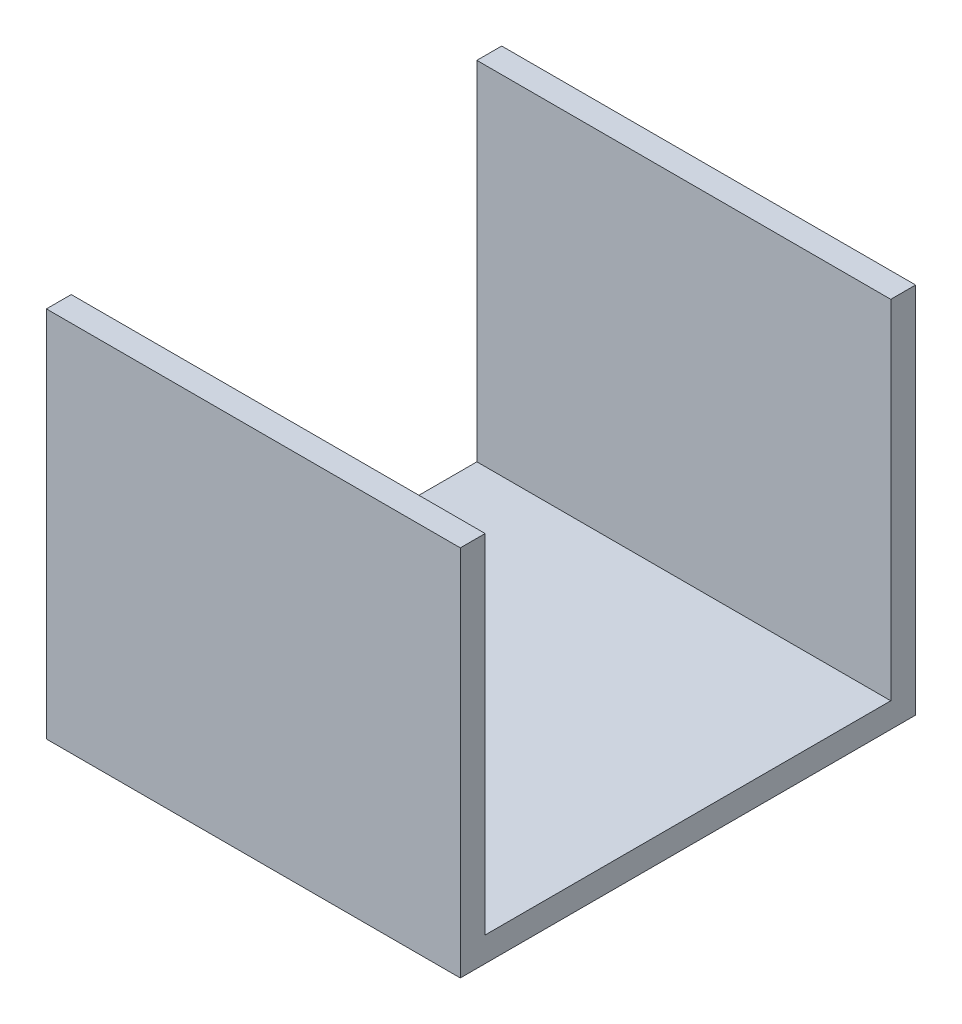
ISO-10303-21;
HEADER;
FILE_DESCRIPTION(('STEP AP214'),'2;1');
FILE_NAME('part.step','',(''),(''),'','','');
FILE_SCHEMA(('AUTOMOTIVE_DESIGN { 1 0 10303 214 1 1 1 1 }'));
ENDSEC;
DATA;
#1=APPLICATION_CONTEXT('core data for automotive mechanical design processes');
#2=APPLICATION_PROTOCOL_DEFINITION('international standard','automotive_design',2000,#1);
#3=PRODUCT_CONTEXT('',#1,'mechanical');
#4=PRODUCT('Part','Part','',(#3));
#5=PRODUCT_RELATED_PRODUCT_CATEGORY('part','',(#4));
#6=PRODUCT_DEFINITION_FORMATION('','',#4);
#7=PRODUCT_DEFINITION_CONTEXT('part definition',#1,'design');
#8=PRODUCT_DEFINITION('design','',#6,#7);
#9=PRODUCT_DEFINITION_SHAPE('','',#8);
#10=(LENGTH_UNIT() NAMED_UNIT(*) SI_UNIT(.MILLI.,.METRE.));
#11=(NAMED_UNIT(*) PLANE_ANGLE_UNIT() SI_UNIT($,.RADIAN.));
#12=(NAMED_UNIT(*) SI_UNIT($,.STERADIAN.) SOLID_ANGLE_UNIT());
#13=UNCERTAINTY_MEASURE_WITH_UNIT(LENGTH_MEASURE(1.E-05),#10,'distance_accuracy_value','');
#14=(GEOMETRIC_REPRESENTATION_CONTEXT(3) GLOBAL_UNCERTAINTY_ASSIGNED_CONTEXT((#13)) GLOBAL_UNIT_ASSIGNED_CONTEXT((#10,
#11,#12)) REPRESENTATION_CONTEXT('',''));
#15=CARTESIAN_POINT('',(0.,0.,0.));
#16=DIRECTION('',(0.,0.,1.));
#17=DIRECTION('',(1.,0.,0.));
#18=AXIS2_PLACEMENT_3D('',#15,#16,#17);
#19=CARTESIAN_POINT('',(0.65,0.005,0.));
#20=DIRECTION('',(0.,-1.,0.));
#21=DIRECTION('',(0.707106781186548,0.,0.707106781186548));
#22=AXIS2_PLACEMENT_3D('',#19,#20,#21);
#23=PLANE('',#22);
#24=DIRECTION('',(1.,0.,0.));
#25=VECTOR('',#24,1.);
#26=CARTESIAN_POINT('',(0.65,0.005,0.03));
#27=LINE('',#26,#25);
#28=CARTESIAN_POINT('',(0.65,0.005,0.03));
#29=VERTEX_POINT('',#28);
#30=CARTESIAN_POINT('',(1.15,0.005,0.03));
#31=VERTEX_POINT('',#30);
#32=EDGE_CURVE('E34',#29,#31,#27,.T.);
#33=ORIENTED_EDGE('',*,*,#32,.F.);
#34=DIRECTION('',(0.,0.,1.));
#35=VECTOR('',#34,1.);
#36=CARTESIAN_POINT('',(0.65,0.005,0.03));
#37=LINE('',#36,#35);
#38=CARTESIAN_POINT('',(0.65,0.005,0.52));
#39=VERTEX_POINT('',#38);
#40=EDGE_CURVE('E11',#29,#39,#37,.T.);
#41=ORIENTED_EDGE('',*,*,#40,.T.);
#42=DIRECTION('',(1.,0.,0.));
#43=VECTOR('',#42,1.);
#44=CARTESIAN_POINT('',(0.65,0.005,0.52));
#45=LINE('',#44,#43);
#46=CARTESIAN_POINT('',(1.15,0.005,0.52));
#47=VERTEX_POINT('',#46);
#48=EDGE_CURVE('E26',#39,#47,#45,.T.);
#49=ORIENTED_EDGE('',*,*,#48,.T.);
#50=DIRECTION('',(0.,0.,1.));
#51=VECTOR('',#50,1.);
#52=CARTESIAN_POINT('',(1.15,0.005,0.03));
#53=LINE('',#52,#51);
#54=EDGE_CURVE('E139',#31,#47,#53,.T.);
#55=ORIENTED_EDGE('',*,*,#54,.F.);
#56=EDGE_LOOP('',(#33,#41,#49,#55));
#57=FACE_BOUND('',#56,.T.);
#58=ADVANCED_FACE('F16',(#57),#23,.F.);
#59=CARTESIAN_POINT('',(0.8,0.,0.52));
#60=DIRECTION('',(0.,0.,1.));
#61=DIRECTION('',(0.707106781186548,0.707106781186548,0.));
#62=AXIS2_PLACEMENT_3D('',#59,#60,#61);
#63=PLANE('',#62);
#64=DIRECTION('',(-1.,0.,0.));
#65=VECTOR('',#64,1.);
#66=CARTESIAN_POINT('',(1.15,0.425,0.52));
#67=LINE('',#66,#65);
#68=CARTESIAN_POINT('',(1.15,0.425,0.52));
#69=VERTEX_POINT('',#68);
#70=CARTESIAN_POINT('',(0.65,0.425,0.52));
#71=VERTEX_POINT('',#70);
#72=EDGE_CURVE('E122',#69,#71,#67,.T.);
#73=ORIENTED_EDGE('',*,*,#72,.F.);
#74=DIRECTION('',(0.,1.,0.));
#75=VECTOR('',#74,1.);
#76=CARTESIAN_POINT('',(1.15,0.005,0.52));
#77=LINE('',#76,#75);
#78=EDGE_CURVE('E118',#47,#69,#77,.T.);
#79=ORIENTED_EDGE('',*,*,#78,.F.);
#80=ORIENTED_EDGE('',*,*,#48,.F.);
#81=DIRECTION('',(0.,-1.,0.));
#82=VECTOR('',#81,1.);
#83=CARTESIAN_POINT('',(0.65,0.425,0.52));
#84=LINE('',#83,#82);
#85=EDGE_CURVE('E114',#71,#39,#84,.T.);
#86=ORIENTED_EDGE('',*,*,#85,.F.);
#87=EDGE_LOOP('',(#73,#79,#80,#86));
#88=FACE_BOUND('',#87,.T.);
#89=ADVANCED_FACE('F156',(#88),#63,.F.);
#90=CARTESIAN_POINT('',(0.8,0.,0.03));
#91=DIRECTION('',(0.,0.,1.));
#92=DIRECTION('',(0.707106781186548,0.707106781186548,0.));
#93=AXIS2_PLACEMENT_3D('',#90,#91,#92);
#94=PLANE('',#93);
#95=DIRECTION('',(0.,1.,0.));
#96=VECTOR('',#95,1.);
#97=CARTESIAN_POINT('',(1.15,0.005,0.03));
#98=LINE('',#97,#96);
#99=CARTESIAN_POINT('',(1.15,0.425,0.03));
#100=VERTEX_POINT('',#99);
#101=EDGE_CURVE('E134',#31,#100,#98,.T.);
#102=ORIENTED_EDGE('',*,*,#101,.T.);
#103=DIRECTION('',(-1.,0.,0.));
#104=VECTOR('',#103,1.);
#105=CARTESIAN_POINT('',(1.15,0.425,0.03));
#106=LINE('',#105,#104);
#107=CARTESIAN_POINT('',(0.65,0.425,0.03));
#108=VERTEX_POINT('',#107);
#109=EDGE_CURVE('E131',#100,#108,#106,.T.);
#110=ORIENTED_EDGE('',*,*,#109,.T.);
#111=DIRECTION('',(0.,-1.,0.));
#112=VECTOR('',#111,1.);
#113=CARTESIAN_POINT('',(0.65,0.425,0.03));
#114=LINE('',#113,#112);
#115=EDGE_CURVE('E128',#108,#29,#114,.T.);
#116=ORIENTED_EDGE('',*,*,#115,.T.);
#117=ORIENTED_EDGE('',*,*,#32,.T.);
#118=EDGE_LOOP('',(#102,#110,#116,#117));
#119=FACE_BOUND('',#118,.T.);
#120=ADVANCED_FACE('F147',(#119),#94,.T.);
#121=CARTESIAN_POINT('',(1.15,0.425,0.));
#122=DIRECTION('',(0.,1.,0.));
#123=DIRECTION('',(0.707106781186548,0.,0.707106781186548));
#124=AXIS2_PLACEMENT_3D('',#121,#122,#123);
#125=PLANE('',#124);
#126=ORIENTED_EDGE('',*,*,#109,.F.);
#127=DIRECTION('',(0.,0.,1.));
#128=VECTOR('',#127,1.);
#129=CARTESIAN_POINT('',(1.15,0.425,0.));
#130=LINE('',#129,#128);
#131=CARTESIAN_POINT('',(1.15,0.425,0.));
#132=VERTEX_POINT('',#131);
#133=EDGE_CURVE('E102',#132,#100,#130,.T.);
#134=ORIENTED_EDGE('',*,*,#133,.F.);
#135=DIRECTION('',(-1.,0.,0.));
#136=VECTOR('',#135,1.);
#137=CARTESIAN_POINT('',(1.15,0.425,0.));
#138=LINE('',#137,#136);
#139=CARTESIAN_POINT('',(0.65,0.425,0.));
#140=VERTEX_POINT('',#139);
#141=EDGE_CURVE('E100',#132,#140,#138,.T.);
#142=ORIENTED_EDGE('',*,*,#141,.T.);
#143=DIRECTION('',(0.,0.,1.));
#144=VECTOR('',#143,1.);
#145=CARTESIAN_POINT('',(0.65,0.425,0.));
#146=LINE('',#145,#144);
#147=EDGE_CURVE('E123',#140,#108,#146,.T.);
#148=ORIENTED_EDGE('',*,*,#147,.T.);
#149=EDGE_LOOP('',(#126,#134,#142,#148));
#150=FACE_BOUND('',#149,.T.);
#151=ADVANCED_FACE('F149',(#150),#125,.T.);
#152=CARTESIAN_POINT('',(1.15,0.425,0.));
#153=DIRECTION('',(0.,1.,0.));
#154=DIRECTION('',(0.707106781186548,0.,0.707106781186548));
#155=AXIS2_PLACEMENT_3D('',#152,#153,#154);
#156=PLANE('',#155);
#157=ORIENTED_EDGE('',*,*,#72,.T.);
#158=DIRECTION('',(0.,0.,1.));
#159=VECTOR('',#158,1.);
#160=CARTESIAN_POINT('',(0.65,0.425,0.52));
#161=LINE('',#160,#159);
#162=CARTESIAN_POINT('',(0.65,0.425,0.55));
#163=VERTEX_POINT('',#162);
#164=EDGE_CURVE('E116',#71,#163,#161,.T.);
#165=ORIENTED_EDGE('',*,*,#164,.T.);
#166=DIRECTION('',(-1.,0.,0.));
#167=VECTOR('',#166,1.);
#168=CARTESIAN_POINT('',(1.15,0.425,0.55));
#169=LINE('',#168,#167);
#170=CARTESIAN_POINT('',(1.15,0.425,0.55));
#171=VERTEX_POINT('',#170);
#172=EDGE_CURVE('E111',#171,#163,#169,.T.);
#173=ORIENTED_EDGE('',*,*,#172,.F.);
#174=DIRECTION('',(0.,0.,1.));
#175=VECTOR('',#174,1.);
#176=CARTESIAN_POINT('',(1.15,0.425,0.52));
#177=LINE('',#176,#175);
#178=EDGE_CURVE('E101',#69,#171,#177,.T.);
#179=ORIENTED_EDGE('',*,*,#178,.F.);
#180=EDGE_LOOP('',(#157,#165,#173,#179));
#181=FACE_BOUND('',#180,.T.);
#182=ADVANCED_FACE('F162',(#181),#156,.T.);
#183=CARTESIAN_POINT('',(0.65,0.425,0.));
#184=DIRECTION('',(-1.,0.,0.));
#185=DIRECTION('',(0.,0.707106781186548,0.707106781186548));
#186=AXIS2_PLACEMENT_3D('',#183,#184,#185);
#187=PLANE('',#186);
#188=ORIENTED_EDGE('',*,*,#115,.F.);
#189=ORIENTED_EDGE('',*,*,#147,.F.);
#190=DIRECTION('',(0.,-1.,0.));
#191=VECTOR('',#190,1.);
#192=CARTESIAN_POINT('',(0.65,0.425,0.));
#193=LINE('',#192,#191);
#194=CARTESIAN_POINT('',(0.65,-0.025,0.));
#195=VERTEX_POINT('',#194);
#196=EDGE_CURVE('E113',#140,#195,#193,.T.);
#197=ORIENTED_EDGE('',*,*,#196,.T.);
#198=DIRECTION('',(0.,0.,1.));
#199=VECTOR('',#198,1.);
#200=CARTESIAN_POINT('',(0.65,-0.025,0.));
#201=LINE('',#200,#199);
#202=CARTESIAN_POINT('',(0.65,-0.025,0.55));
#203=VERTEX_POINT('',#202);
#204=EDGE_CURVE('E105',#195,#203,#201,.T.);
#205=ORIENTED_EDGE('',*,*,#204,.T.);
#206=DIRECTION('',(0.,-1.,0.));
#207=VECTOR('',#206,1.);
#208=CARTESIAN_POINT('',(0.65,0.425,0.55));
#209=LINE('',#208,#207);
#210=EDGE_CURVE('E109',#163,#203,#209,.T.);
#211=ORIENTED_EDGE('',*,*,#210,.F.);
#212=ORIENTED_EDGE('',*,*,#164,.F.);
#213=ORIENTED_EDGE('',*,*,#85,.T.);
#214=ORIENTED_EDGE('',*,*,#40,.F.);
#215=EDGE_LOOP('',(#188,#189,#197,#205,#211,#212,#213,#214));
#216=FACE_BOUND('',#215,.T.);
#217=ADVANCED_FACE('F151',(#216),#187,.T.);
#218=CARTESIAN_POINT('',(1.15,-0.025,0.));
#219=DIRECTION('',(1.,0.,0.));
#220=DIRECTION('',(0.,0.707106781186548,0.707106781186548));
#221=AXIS2_PLACEMENT_3D('',#218,#219,#220);
#222=PLANE('',#221);
#223=ORIENTED_EDGE('',*,*,#101,.F.);
#224=ORIENTED_EDGE('',*,*,#54,.T.);
#225=ORIENTED_EDGE('',*,*,#78,.T.);
#226=ORIENTED_EDGE('',*,*,#178,.T.);
#227=DIRECTION('',(0.,1.,0.));
#228=VECTOR('',#227,1.);
#229=CARTESIAN_POINT('',(1.15,-0.025,0.55));
#230=LINE('',#229,#228);
#231=CARTESIAN_POINT('',(1.15,-0.025,0.55));
#232=VERTEX_POINT('',#231);
#233=EDGE_CURVE('E90',#232,#171,#230,.T.);
#234=ORIENTED_EDGE('',*,*,#233,.F.);
#235=DIRECTION('',(0.,0.,1.));
#236=VECTOR('',#235,1.);
#237=CARTESIAN_POINT('',(1.15,-0.025,0.));
#238=LINE('',#237,#236);
#239=CARTESIAN_POINT('',(1.15,-0.025,0.));
#240=VERTEX_POINT('',#239);
#241=EDGE_CURVE('E79',#240,#232,#238,.T.);
#242=ORIENTED_EDGE('',*,*,#241,.F.);
#243=DIRECTION('',(0.,1.,0.));
#244=VECTOR('',#243,1.);
#245=CARTESIAN_POINT('',(1.15,-0.025,0.));
#246=LINE('',#245,#244);
#247=EDGE_CURVE('E87',#240,#132,#246,.T.);
#248=ORIENTED_EDGE('',*,*,#247,.T.);
#249=ORIENTED_EDGE('',*,*,#133,.T.);
#250=EDGE_LOOP('',(#223,#224,#225,#226,#234,#242,#248,#249));
#251=FACE_BOUND('',#250,.T.);
#252=ADVANCED_FACE('F85',(#251),#222,.T.);
#253=CARTESIAN_POINT('',(0.8,0.,0.));
#254=DIRECTION('',(0.,0.,1.));
#255=DIRECTION('',(0.707106781186548,0.707106781186548,0.));
#256=AXIS2_PLACEMENT_3D('',#253,#254,#255);
#257=PLANE('',#256);
#258=ORIENTED_EDGE('',*,*,#247,.F.);
#259=DIRECTION('',(1.,0.,0.));
#260=VECTOR('',#259,1.);
#261=CARTESIAN_POINT('',(0.65,-0.025,0.));
#262=LINE('',#261,#260);
#263=EDGE_CURVE('E92',#195,#240,#262,.T.);
#264=ORIENTED_EDGE('',*,*,#263,.F.);
#265=ORIENTED_EDGE('',*,*,#196,.F.);
#266=ORIENTED_EDGE('',*,*,#141,.F.);
#267=EDGE_LOOP('',(#258,#264,#265,#266));
#268=FACE_BOUND('',#267,.T.);
#269=ADVANCED_FACE('F97',(#268),#257,.F.);
#270=CARTESIAN_POINT('',(0.8,0.,0.55));
#271=DIRECTION('',(0.,0.,1.));
#272=DIRECTION('',(0.707106781186548,0.707106781186548,0.));
#273=AXIS2_PLACEMENT_3D('',#270,#271,#272);
#274=PLANE('',#273);
#275=ORIENTED_EDGE('',*,*,#172,.T.);
#276=ORIENTED_EDGE('',*,*,#210,.T.);
#277=DIRECTION('',(1.,0.,0.));
#278=VECTOR('',#277,1.);
#279=CARTESIAN_POINT('',(0.65,-0.025,0.55));
#280=LINE('',#279,#278);
#281=EDGE_CURVE('E20',#203,#232,#280,.T.);
#282=ORIENTED_EDGE('',*,*,#281,.T.);
#283=ORIENTED_EDGE('',*,*,#233,.T.);
#284=EDGE_LOOP('',(#275,#276,#282,#283));
#285=FACE_BOUND('',#284,.T.);
#286=ADVANCED_FACE('F160',(#285),#274,.T.);
#287=CARTESIAN_POINT('',(0.65,-0.025,0.));
#288=DIRECTION('',(0.,-1.,0.));
#289=DIRECTION('',(0.707106781186548,0.,0.707106781186548));
#290=AXIS2_PLACEMENT_3D('',#287,#288,#289);
#291=PLANE('',#290);
#292=ORIENTED_EDGE('',*,*,#263,.T.);
#293=ORIENTED_EDGE('',*,*,#241,.T.);
#294=ORIENTED_EDGE('',*,*,#281,.F.);
#295=ORIENTED_EDGE('',*,*,#204,.F.);
#296=EDGE_LOOP('',(#292,#293,#294,#295));
#297=FACE_BOUND('',#296,.T.);
#298=ADVANCED_FACE('F18',(#297),#291,.T.);
#299=CLOSED_SHELL('',(#58,#89,#120,#151,#182,#217,#252,#269,#286,#298));
#300=MANIFOLD_SOLID_BREP('B1',#299);
#301=ADVANCED_BREP_SHAPE_REPRESENTATION('',(#18,#300),#14);
#302=SHAPE_DEFINITION_REPRESENTATION(#9,#301);
ENDSEC;
END-ISO-10303-21;
